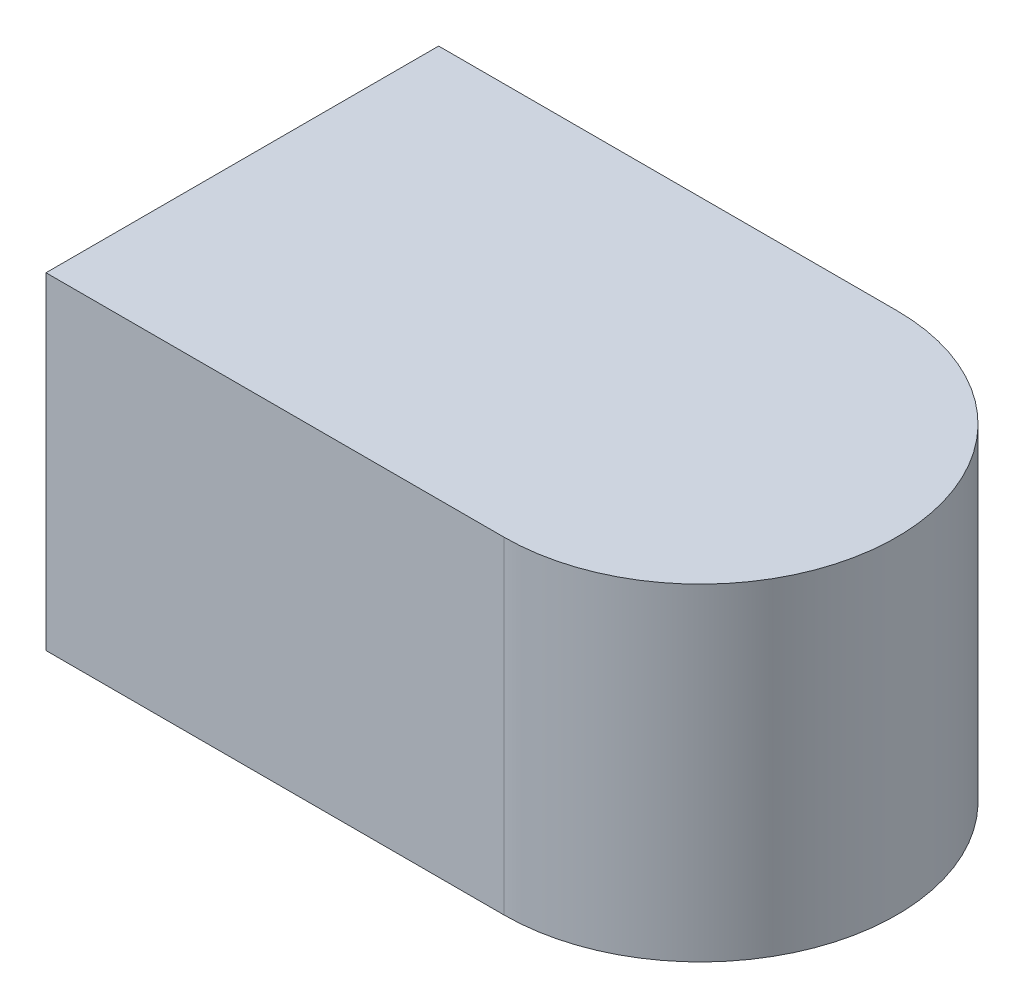
ISO-10303-21;
HEADER;
FILE_DESCRIPTION(('STEP AP214'),'2;1');
FILE_NAME('part.step','',(''),(''),'','','');
FILE_SCHEMA(('AUTOMOTIVE_DESIGN { 1 0 10303 214 1 1 1 1 }'));
ENDSEC;
DATA;
#1=APPLICATION_CONTEXT('core data for automotive mechanical design processes');
#2=APPLICATION_PROTOCOL_DEFINITION('international standard','automotive_design',2000,#1);
#3=PRODUCT_CONTEXT('',#1,'mechanical');
#4=PRODUCT('Part','Part','',(#3));
#5=PRODUCT_RELATED_PRODUCT_CATEGORY('part','',(#4));
#6=PRODUCT_DEFINITION_FORMATION('','',#4);
#7=PRODUCT_DEFINITION_CONTEXT('part definition',#1,'design');
#8=PRODUCT_DEFINITION('design','',#6,#7);
#9=PRODUCT_DEFINITION_SHAPE('','',#8);
#10=(LENGTH_UNIT() NAMED_UNIT(*) SI_UNIT(.MILLI.,.METRE.));
#11=(NAMED_UNIT(*) PLANE_ANGLE_UNIT() SI_UNIT($,.RADIAN.));
#12=(NAMED_UNIT(*) SI_UNIT($,.STERADIAN.) SOLID_ANGLE_UNIT());
#13=UNCERTAINTY_MEASURE_WITH_UNIT(LENGTH_MEASURE(1.E-05),#10,'distance_accuracy_value','');
#14=(GEOMETRIC_REPRESENTATION_CONTEXT(3) GLOBAL_UNCERTAINTY_ASSIGNED_CONTEXT((#13)) GLOBAL_UNIT_ASSIGNED_CONTEXT((#10,
#11,#12)) REPRESENTATION_CONTEXT('',''));
#15=CARTESIAN_POINT('',(0.,0.,0.));
#16=DIRECTION('',(0.,0.,1.));
#17=DIRECTION('',(1.,0.,0.));
#18=AXIS2_PLACEMENT_3D('',#15,#16,#17);
#19=CARTESIAN_POINT('',(0.,0.,0.));
#20=DIRECTION('',(0.,-1.,0.));
#21=DIRECTION('',(-1.,0.,0.));
#22=AXIS2_PLACEMENT_3D('',#19,#20,#21);
#23=PLANE('',#22);
#24=CARTESIAN_POINT('',(-1.47,0.,-0.25));
#25=DIRECTION('',(0.,-1.,0.));
#26=DIRECTION('',(0.,0.,-1.));
#27=AXIS2_PLACEMENT_3D('',#24,#25,#26);
#28=CIRCLE('',#27,0.12);
#29=CARTESIAN_POINT('',(-1.47,0.,-0.37));
#30=VERTEX_POINT('',#29);
#31=CARTESIAN_POINT('',(-1.47,0.,-0.13));
#32=VERTEX_POINT('',#31);
#33=EDGE_CURVE('E11',#30,#32,#28,.T.);
#34=ORIENTED_EDGE('',*,*,#33,.T.);
#35=DIRECTION('',(-1.,0.,0.));
#36=VECTOR('',#35,1.);
#37=CARTESIAN_POINT('',(-1.47,0.,-0.13));
#38=LINE('',#37,#36);
#39=CARTESIAN_POINT('',(-1.75,0.,-0.13));
#40=VERTEX_POINT('',#39);
#41=EDGE_CURVE('E24',#32,#40,#38,.T.);
#42=ORIENTED_EDGE('',*,*,#41,.T.);
#43=DIRECTION('',(0.,0.,-1.));
#44=VECTOR('',#43,1.);
#45=CARTESIAN_POINT('',(-1.75,0.,-0.13));
#46=LINE('',#45,#44);
#47=CARTESIAN_POINT('',(-1.75,0.,-0.37));
#48=VERTEX_POINT('',#47);
#49=EDGE_CURVE('E62',#40,#48,#46,.T.);
#50=ORIENTED_EDGE('',*,*,#49,.T.);
#51=DIRECTION('',(1.,0.,0.));
#52=VECTOR('',#51,1.);
#53=CARTESIAN_POINT('',(-1.75,0.,-0.37));
#54=LINE('',#53,#52);
#55=EDGE_CURVE('E36',#48,#30,#54,.T.);
#56=ORIENTED_EDGE('',*,*,#55,.T.);
#57=EDGE_LOOP('',(#34,#42,#50,#56));
#58=FACE_BOUND('',#57,.T.);
#59=ADVANCED_FACE('F17',(#58),#23,.T.);
#60=CARTESIAN_POINT('',(-1.75,0.,-0.37));
#61=DIRECTION('',(0.,0.,1.));
#62=DIRECTION('',(1.,0.,0.));
#63=AXIS2_PLACEMENT_3D('',#60,#61,#62);
#64=PLANE('',#63);
#65=DIRECTION('',(0.,1.,0.));
#66=VECTOR('',#65,1.);
#67=CARTESIAN_POINT('',(-1.75,0.,-0.37));
#68=LINE('',#67,#66);
#69=CARTESIAN_POINT('',(-1.75,0.2,-0.37));
#70=VERTEX_POINT('',#69);
#71=EDGE_CURVE('E84',#48,#70,#68,.T.);
#72=ORIENTED_EDGE('',*,*,#71,.T.);
#73=DIRECTION('',(1.,0.,0.));
#74=VECTOR('',#73,1.);
#75=CARTESIAN_POINT('',(-1.75,0.2,-0.37));
#76=LINE('',#75,#74);
#77=CARTESIAN_POINT('',(-1.47,0.2,-0.37));
#78=VERTEX_POINT('',#77);
#79=EDGE_CURVE('E74',#70,#78,#76,.T.);
#80=ORIENTED_EDGE('',*,*,#79,.T.);
#81=DIRECTION('',(0.,1.,0.));
#82=VECTOR('',#81,1.);
#83=CARTESIAN_POINT('',(-1.47,0.,-0.37));
#84=LINE('',#83,#82);
#85=EDGE_CURVE('E81',#30,#78,#84,.T.);
#86=ORIENTED_EDGE('',*,*,#85,.F.);
#87=ORIENTED_EDGE('',*,*,#55,.F.);
#88=EDGE_LOOP('',(#72,#80,#86,#87));
#89=FACE_BOUND('',#88,.T.);
#90=ADVANCED_FACE('F91',(#89),#64,.F.);
#91=CARTESIAN_POINT('',(-1.47,0.,-0.25));
#92=DIRECTION('',(0.,-1.,0.));
#93=DIRECTION('',(-1.,0.,0.));
#94=AXIS2_PLACEMENT_3D('',#91,#92,#93);
#95=CYLINDRICAL_SURFACE('',#94,0.12);
#96=ORIENTED_EDGE('',*,*,#85,.T.);
#97=CARTESIAN_POINT('',(-1.47,0.2,-0.25));
#98=DIRECTION('',(0.,-1.,0.));
#99=DIRECTION('',(0.,0.,-1.));
#100=AXIS2_PLACEMENT_3D('',#97,#98,#99);
#101=CIRCLE('',#100,0.12);
#102=CARTESIAN_POINT('',(-1.47,0.2,-0.13));
#103=VERTEX_POINT('',#102);
#104=EDGE_CURVE('E79',#78,#103,#101,.T.);
#105=ORIENTED_EDGE('',*,*,#104,.T.);
#106=DIRECTION('',(0.,1.,0.));
#107=VECTOR('',#106,1.);
#108=CARTESIAN_POINT('',(-1.47,0.,-0.13));
#109=LINE('',#108,#107);
#110=EDGE_CURVE('E68',#32,#103,#109,.T.);
#111=ORIENTED_EDGE('',*,*,#110,.F.);
#112=ORIENTED_EDGE('',*,*,#33,.F.);
#113=EDGE_LOOP('',(#96,#105,#111,#112));
#114=FACE_BOUND('',#113,.T.);
#115=ADVANCED_FACE('F89',(#114),#95,.T.);
#116=CARTESIAN_POINT('',(-1.47,0.,-0.13));
#117=DIRECTION('',(0.,0.,-1.));
#118=DIRECTION('',(-1.,0.,0.));
#119=AXIS2_PLACEMENT_3D('',#116,#117,#118);
#120=PLANE('',#119);
#121=ORIENTED_EDGE('',*,*,#110,.T.);
#122=DIRECTION('',(-1.,0.,0.));
#123=VECTOR('',#122,1.);
#124=CARTESIAN_POINT('',(-1.47,0.2,-0.13));
#125=LINE('',#124,#123);
#126=CARTESIAN_POINT('',(-1.75,0.2,-0.13));
#127=VERTEX_POINT('',#126);
#128=EDGE_CURVE('E63',#103,#127,#125,.T.);
#129=ORIENTED_EDGE('',*,*,#128,.T.);
#130=DIRECTION('',(0.,1.,0.));
#131=VECTOR('',#130,1.);
#132=CARTESIAN_POINT('',(-1.75,0.,-0.13));
#133=LINE('',#132,#131);
#134=EDGE_CURVE('E56',#40,#127,#133,.T.);
#135=ORIENTED_EDGE('',*,*,#134,.F.);
#136=ORIENTED_EDGE('',*,*,#41,.F.);
#137=EDGE_LOOP('',(#121,#129,#135,#136));
#138=FACE_BOUND('',#137,.T.);
#139=ADVANCED_FACE('F66',(#138),#120,.F.);
#140=CARTESIAN_POINT('',(-1.75,0.,-0.13));
#141=DIRECTION('',(1.,0.,0.));
#142=DIRECTION('',(0.,0.,-1.));
#143=AXIS2_PLACEMENT_3D('',#140,#141,#142);
#144=PLANE('',#143);
#145=ORIENTED_EDGE('',*,*,#134,.T.);
#146=DIRECTION('',(0.,0.,-1.));
#147=VECTOR('',#146,1.);
#148=CARTESIAN_POINT('',(-1.75,0.2,-0.13));
#149=LINE('',#148,#147);
#150=EDGE_CURVE('E61',#127,#70,#149,.T.);
#151=ORIENTED_EDGE('',*,*,#150,.T.);
#152=ORIENTED_EDGE('',*,*,#71,.F.);
#153=ORIENTED_EDGE('',*,*,#49,.F.);
#154=EDGE_LOOP('',(#145,#151,#152,#153));
#155=FACE_BOUND('',#154,.T.);
#156=ADVANCED_FACE('F58',(#155),#144,.F.);
#157=CARTESIAN_POINT('',(0.,0.2,0.));
#158=DIRECTION('',(0.,-1.,0.));
#159=DIRECTION('',(-1.,0.,0.));
#160=AXIS2_PLACEMENT_3D('',#157,#158,#159);
#161=PLANE('',#160);
#162=ORIENTED_EDGE('',*,*,#150,.F.);
#163=ORIENTED_EDGE('',*,*,#128,.F.);
#164=ORIENTED_EDGE('',*,*,#104,.F.);
#165=ORIENTED_EDGE('',*,*,#79,.F.);
#166=EDGE_LOOP('',(#162,#163,#164,#165));
#167=FACE_BOUND('',#166,.T.);
#168=ADVANCED_FACE('F72',(#167),#161,.F.);
#169=CLOSED_SHELL('',(#59,#90,#115,#139,#156,#168));
#170=MANIFOLD_SOLID_BREP('B1',#169);
#171=ADVANCED_BREP_SHAPE_REPRESENTATION('',(#18,#170),#14);
#172=SHAPE_DEFINITION_REPRESENTATION(#9,#171);
ENDSEC;
END-ISO-10303-21;
